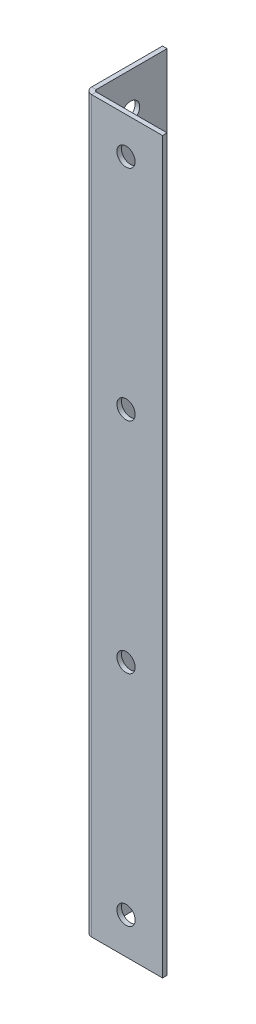
ISO-10303-21;
HEADER;
FILE_DESCRIPTION(('STEP AP214'),'2;1');
FILE_NAME('part.step','',(''),(''),'','','');
FILE_SCHEMA(('AUTOMOTIVE_DESIGN { 1 0 10303 214 1 1 1 1 }'));
ENDSEC;
DATA;
#1=APPLICATION_CONTEXT('core data for automotive mechanical design processes');
#2=APPLICATION_PROTOCOL_DEFINITION('international standard','automotive_design',2000,#1);
#3=PRODUCT_CONTEXT('',#1,'mechanical');
#4=PRODUCT('Part','Part','',(#3));
#5=PRODUCT_RELATED_PRODUCT_CATEGORY('part','',(#4));
#6=PRODUCT_DEFINITION_FORMATION('','',#4);
#7=PRODUCT_DEFINITION_CONTEXT('part definition',#1,'design');
#8=PRODUCT_DEFINITION('design','',#6,#7);
#9=PRODUCT_DEFINITION_SHAPE('','',#8);
#10=(LENGTH_UNIT() NAMED_UNIT(*) SI_UNIT(.MILLI.,.METRE.));
#11=(NAMED_UNIT(*) PLANE_ANGLE_UNIT() SI_UNIT($,.RADIAN.));
#12=(NAMED_UNIT(*) SI_UNIT($,.STERADIAN.) SOLID_ANGLE_UNIT());
#13=UNCERTAINTY_MEASURE_WITH_UNIT(LENGTH_MEASURE(1.E-05),#10,'distance_accuracy_value','');
#14=(GEOMETRIC_REPRESENTATION_CONTEXT(3) GLOBAL_UNCERTAINTY_ASSIGNED_CONTEXT((#13)) GLOBAL_UNIT_ASSIGNED_CONTEXT((#10,
#11,#12)) REPRESENTATION_CONTEXT('',''));
#15=CARTESIAN_POINT('',(0.,0.,0.));
#16=DIRECTION('',(0.,0.,1.));
#17=DIRECTION('',(1.,0.,0.));
#18=AXIS2_PLACEMENT_3D('',#15,#16,#17);
#19=CARTESIAN_POINT('',(0.7366,254.,0.));
#20=DIRECTION('',(0.,1.,0.));
#21=DIRECTION('',(0.,0.,1.));
#22=AXIS2_PLACEMENT_3D('',#19,#20,#21);
#23=PLANE('',#22);
#24=DIRECTION('',(0.,0.,1.));
#25=VECTOR('',#24,1.);
#26=CARTESIAN_POINT('',(0.7366,254.,0.));
#27=LINE('',#26,#25);
#28=CARTESIAN_POINT('',(0.7366,254.,0.));
#29=VERTEX_POINT('',#28);
#30=CARTESIAN_POINT('',(0.7366,254.,1.5875));
#31=VERTEX_POINT('',#30);
#32=EDGE_CURVE('E11',#29,#31,#27,.T.);
#33=ORIENTED_EDGE('',*,*,#32,.F.);
#34=CARTESIAN_POINT('',(0.7366,254.,-0.7366));
#35=DIRECTION('',(0.,-1.,0.));
#36=DIRECTION('',(0.,0.,-1.));
#37=AXIS2_PLACEMENT_3D('',#34,#35,#36);
#38=CIRCLE('',#37,0.7366);
#39=CARTESIAN_POINT('',(0.,254.,-0.7366));
#40=VERTEX_POINT('',#39);
#41=EDGE_CURVE('E136',#40,#29,#38,.F.);
#42=ORIENTED_EDGE('',*,*,#41,.F.);
#43=DIRECTION('',(1.,0.,0.));
#44=VECTOR('',#43,1.);
#45=CARTESIAN_POINT('',(-1.5875,254.,-0.736600000000001));
#46=LINE('',#45,#44);
#47=CARTESIAN_POINT('',(-1.5875,254.,-0.736600000000001));
#48=VERTEX_POINT('',#47);
#49=EDGE_CURVE('E46',#48,#40,#46,.T.);
#50=ORIENTED_EDGE('',*,*,#49,.F.);
#51=CARTESIAN_POINT('',(0.7366,254.,-0.7366));
#52=DIRECTION('',(0.,1.,0.));
#53=DIRECTION('',(1.,0.,0.));
#54=AXIS2_PLACEMENT_3D('',#51,#52,#53);
#55=CIRCLE('',#54,2.3241);
#56=EDGE_CURVE('E129',#48,#31,#55,.T.);
#57=ORIENTED_EDGE('',*,*,#56,.T.);
#58=EDGE_LOOP('',(#33,#42,#50,#57));
#59=FACE_BOUND('',#58,.T.);
#60=ADVANCED_FACE('F37',(#59),#23,.T.);
#61=CARTESIAN_POINT('',(-1.5875,254.,-0.736600000000001));
#62=DIRECTION('',(0.,1.,0.));
#63=DIRECTION('',(0.,0.,1.));
#64=AXIS2_PLACEMENT_3D('',#61,#62,#63);
#65=PLANE('',#64);
#66=DIRECTION('',(1.,0.,0.));
#67=VECTOR('',#66,1.);
#68=CARTESIAN_POINT('',(0.,254.,0.));
#69=LINE('',#68,#67);
#70=CARTESIAN_POINT('',(25.4,254.,0.));
#71=VERTEX_POINT('',#70);
#72=EDGE_CURVE('E203',#29,#71,#69,.T.);
#73=ORIENTED_EDGE('',*,*,#72,.F.);
#74=ORIENTED_EDGE('',*,*,#32,.T.);
#75=DIRECTION('',(1.,0.,0.));
#76=VECTOR('',#75,1.);
#77=CARTESIAN_POINT('',(0.,254.,1.5875));
#78=LINE('',#77,#76);
#79=CARTESIAN_POINT('',(25.4,254.,1.5875));
#80=VERTEX_POINT('',#79);
#81=EDGE_CURVE('E95',#31,#80,#78,.T.);
#82=ORIENTED_EDGE('',*,*,#81,.T.);
#83=DIRECTION('',(0.,0.,1.));
#84=VECTOR('',#83,1.);
#85=CARTESIAN_POINT('',(25.4,254.,0.));
#86=LINE('',#85,#84);
#87=EDGE_CURVE('E200',#71,#80,#86,.T.);
#88=ORIENTED_EDGE('',*,*,#87,.F.);
#89=EDGE_LOOP('',(#73,#74,#82,#88));
#90=FACE_BOUND('',#89,.T.);
#91=ADVANCED_FACE('F223',(#90),#65,.T.);
#92=CARTESIAN_POINT('',(0.,0.,-0.7366));
#93=DIRECTION('',(0.,-1.,0.));
#94=DIRECTION('',(0.,0.,-1.));
#95=AXIS2_PLACEMENT_3D('',#92,#93,#94);
#96=PLANE('',#95);
#97=DIRECTION('',(-1.,0.,0.));
#98=VECTOR('',#97,1.);
#99=CARTESIAN_POINT('',(0.,0.,-0.7366));
#100=LINE('',#99,#98);
#101=CARTESIAN_POINT('',(0.,0.,-0.7366));
#102=VERTEX_POINT('',#101);
#103=CARTESIAN_POINT('',(-1.5875,0.,-0.736600000000001));
#104=VERTEX_POINT('',#103);
#105=EDGE_CURVE('E82',#102,#104,#100,.T.);
#106=ORIENTED_EDGE('',*,*,#105,.F.);
#107=CARTESIAN_POINT('',(0.7366,0.,-0.7366));
#108=DIRECTION('',(0.,-1.,0.));
#109=DIRECTION('',(0.,0.,-1.));
#110=AXIS2_PLACEMENT_3D('',#107,#108,#109);
#111=CIRCLE('',#110,0.7366);
#112=CARTESIAN_POINT('',(0.7366,0.,0.));
#113=VERTEX_POINT('',#112);
#114=EDGE_CURVE('E152',#102,#113,#111,.F.);
#115=ORIENTED_EDGE('',*,*,#114,.T.);
#116=DIRECTION('',(0.,0.,-1.));
#117=VECTOR('',#116,1.);
#118=CARTESIAN_POINT('',(0.7366,0.,1.5875));
#119=LINE('',#118,#117);
#120=CARTESIAN_POINT('',(0.7366,0.,1.5875));
#121=VERTEX_POINT('',#120);
#122=EDGE_CURVE('E89',#121,#113,#119,.T.);
#123=ORIENTED_EDGE('',*,*,#122,.F.);
#124=CARTESIAN_POINT('',(0.7366,0.,-0.7366));
#125=DIRECTION('',(0.,1.,0.));
#126=DIRECTION('',(1.,0.,0.));
#127=AXIS2_PLACEMENT_3D('',#124,#125,#126);
#128=CIRCLE('',#127,2.3241);
#129=EDGE_CURVE('E159',#104,#121,#128,.T.);
#130=ORIENTED_EDGE('',*,*,#129,.F.);
#131=EDGE_LOOP('',(#106,#115,#123,#130));
#132=FACE_BOUND('',#131,.T.);
#133=ADVANCED_FACE('F221',(#132),#96,.T.);
#134=CARTESIAN_POINT('',(0.7366,0.,1.5875));
#135=DIRECTION('',(0.,-1.,0.));
#136=DIRECTION('',(0.,0.,-1.));
#137=AXIS2_PLACEMENT_3D('',#134,#135,#136);
#138=PLANE('',#137);
#139=DIRECTION('',(0.,0.,1.));
#140=VECTOR('',#139,1.);
#141=CARTESIAN_POINT('',(0.,0.,-25.4));
#142=LINE('',#141,#140);
#143=CARTESIAN_POINT('',(0.,0.,-25.4));
#144=VERTEX_POINT('',#143);
#145=EDGE_CURVE('E154',#144,#102,#142,.T.);
#146=ORIENTED_EDGE('',*,*,#145,.T.);
#147=ORIENTED_EDGE('',*,*,#105,.T.);
#148=DIRECTION('',(0.,0.,-1.));
#149=VECTOR('',#148,1.);
#150=CARTESIAN_POINT('',(-1.5875,0.,-25.4));
#151=LINE('',#150,#149);
#152=CARTESIAN_POINT('',(-1.5875,0.,-25.4));
#153=VERTEX_POINT('',#152);
#154=EDGE_CURVE('E157',#153,#104,#151,.F.);
#155=ORIENTED_EDGE('',*,*,#154,.F.);
#156=DIRECTION('',(1.,0.,0.));
#157=VECTOR('',#156,1.);
#158=CARTESIAN_POINT('',(-1.5875,0.,-25.4));
#159=LINE('',#158,#157);
#160=EDGE_CURVE('E117',#153,#144,#159,.T.);
#161=ORIENTED_EDGE('',*,*,#160,.T.);
#162=EDGE_LOOP('',(#146,#147,#155,#161));
#163=FACE_BOUND('',#162,.T.);
#164=ADVANCED_FACE('F217',(#163),#138,.T.);
#165=CARTESIAN_POINT('',(0.,254.,1.5875));
#166=DIRECTION('',(0.,0.,-1.));
#167=DIRECTION('',(-1.,0.,0.));
#168=AXIS2_PLACEMENT_3D('',#165,#166,#167);
#169=PLANE('',#168);
#170=CARTESIAN_POINT('',(12.7000000000008,165.1,1.5875));
#171=DIRECTION('',(0.,0.,1.));
#172=DIRECTION('',(1.,0.,0.));
#173=AXIS2_PLACEMENT_3D('',#170,#171,#172);
#174=CIRCLE('',#173,3.175);
#175=CARTESIAN_POINT('',(15.8750000000008,165.1,1.5875));
#176=VERTEX_POINT('',#175);
#177=EDGE_CURVE('E184',#176,#176,#174,.T.);
#178=ORIENTED_EDGE('',*,*,#177,.F.);
#179=EDGE_LOOP('',(#178));
#180=FACE_BOUND('',#179,.T.);
#181=CARTESIAN_POINT('',(12.7000000000016,88.9,1.5875));
#182=DIRECTION('',(0.,0.,1.));
#183=DIRECTION('',(1.,0.,0.));
#184=AXIS2_PLACEMENT_3D('',#181,#182,#183);
#185=CIRCLE('',#184,3.175);
#186=CARTESIAN_POINT('',(15.8750000000016,88.9,1.5875));
#187=VERTEX_POINT('',#186);
#188=EDGE_CURVE('E494',#187,#187,#185,.T.);
#189=ORIENTED_EDGE('',*,*,#188,.F.);
#190=EDGE_LOOP('',(#189));
#191=FACE_BOUND('',#190,.T.);
#192=CARTESIAN_POINT('',(12.7000000000024,12.7,1.5875));
#193=DIRECTION('',(0.,0.,1.));
#194=DIRECTION('',(1.,0.,0.));
#195=AXIS2_PLACEMENT_3D('',#192,#193,#194);
#196=CIRCLE('',#195,3.175);
#197=CARTESIAN_POINT('',(15.8750000000024,12.7,1.5875));
#198=VERTEX_POINT('',#197);
#199=EDGE_CURVE('E197',#198,#198,#196,.T.);
#200=ORIENTED_EDGE('',*,*,#199,.F.);
#201=EDGE_LOOP('',(#200));
#202=FACE_BOUND('',#201,.T.);
#203=CARTESIAN_POINT('',(12.7,241.3,1.5875));
#204=DIRECTION('',(0.,0.,1.));
#205=DIRECTION('',(1.,0.,0.));
#206=AXIS2_PLACEMENT_3D('',#203,#204,#205);
#207=CIRCLE('',#206,3.175);
#208=CARTESIAN_POINT('',(15.875,241.3,1.5875));
#209=VERTEX_POINT('',#208);
#210=EDGE_CURVE('E180',#209,#209,#207,.T.);
#211=ORIENTED_EDGE('',*,*,#210,.F.);
#212=EDGE_LOOP('',(#211));
#213=FACE_BOUND('',#212,.T.);
#214=DIRECTION('',(1.,0.,0.));
#215=VECTOR('',#214,1.);
#216=CARTESIAN_POINT('',(0.,0.,1.5875));
#217=LINE('',#216,#215);
#218=CARTESIAN_POINT('',(25.4,0.,1.5875));
#219=VERTEX_POINT('',#218);
#220=EDGE_CURVE('E142',#121,#219,#217,.T.);
#221=ORIENTED_EDGE('',*,*,#220,.T.);
#222=DIRECTION('',(0.,-1.,0.));
#223=VECTOR('',#222,1.);
#224=CARTESIAN_POINT('',(25.4,254.,1.5875));
#225=LINE('',#224,#223);
#226=EDGE_CURVE('E173',#80,#219,#225,.T.);
#227=ORIENTED_EDGE('',*,*,#226,.F.);
#228=ORIENTED_EDGE('',*,*,#81,.F.);
#229=DIRECTION('',(0.,-1.,0.));
#230=VECTOR('',#229,1.);
#231=CARTESIAN_POINT('',(0.7366,254.,1.5875));
#232=LINE('',#231,#230);
#233=EDGE_CURVE('E141',#31,#121,#232,.T.);
#234=ORIENTED_EDGE('',*,*,#233,.T.);
#235=EDGE_LOOP('',(#221,#227,#228,#234));
#236=FACE_BOUND('',#235,.T.);
#237=ADVANCED_FACE('F229',(#180,#191,#202,#213,#236),#169,.F.);
#238=CARTESIAN_POINT('',(25.4,254.,0.));
#239=DIRECTION('',(1.,0.,0.));
#240=DIRECTION('',(0.,0.,-1.));
#241=AXIS2_PLACEMENT_3D('',#238,#239,#240);
#242=PLANE('',#241);
#243=DIRECTION('',(0.,0.,1.));
#244=VECTOR('',#243,1.);
#245=CARTESIAN_POINT('',(25.4,0.,0.));
#246=LINE('',#245,#244);
#247=CARTESIAN_POINT('',(25.4,0.,0.));
#248=VERTEX_POINT('',#247);
#249=EDGE_CURVE('E145',#248,#219,#246,.T.);
#250=ORIENTED_EDGE('',*,*,#249,.F.);
#251=DIRECTION('',(0.,-1.,0.));
#252=VECTOR('',#251,1.);
#253=CARTESIAN_POINT('',(25.4,254.,0.));
#254=LINE('',#253,#252);
#255=EDGE_CURVE('E171',#71,#248,#254,.T.);
#256=ORIENTED_EDGE('',*,*,#255,.F.);
#257=ORIENTED_EDGE('',*,*,#87,.T.);
#258=ORIENTED_EDGE('',*,*,#226,.T.);
#259=EDGE_LOOP('',(#250,#256,#257,#258));
#260=FACE_BOUND('',#259,.T.);
#261=ADVANCED_FACE('F258',(#260),#242,.T.);
#262=CARTESIAN_POINT('',(0.,254.,0.));
#263=DIRECTION('',(0.,0.,-1.));
#264=DIRECTION('',(-1.,0.,0.));
#265=AXIS2_PLACEMENT_3D('',#262,#263,#264);
#266=PLANE('',#265);
#267=CARTESIAN_POINT('',(12.7000000000008,165.1,0.));
#268=DIRECTION('',(0.,0.,-1.));
#269=DIRECTION('',(-1.,0.,0.));
#270=AXIS2_PLACEMENT_3D('',#267,#268,#269);
#271=CIRCLE('',#270,3.175);
#272=CARTESIAN_POINT('',(9.5250000000008,165.1,0.));
#273=VERTEX_POINT('',#272);
#274=EDGE_CURVE('E40',#273,#273,#271,.T.);
#275=ORIENTED_EDGE('',*,*,#274,.F.);
#276=EDGE_LOOP('',(#275));
#277=FACE_BOUND('',#276,.T.);
#278=CARTESIAN_POINT('',(12.7000000000016,88.9,0.));
#279=DIRECTION('',(0.,0.,-1.));
#280=DIRECTION('',(-1.,0.,0.));
#281=AXIS2_PLACEMENT_3D('',#278,#279,#280);
#282=CIRCLE('',#281,3.175);
#283=CARTESIAN_POINT('',(9.5250000000016,88.9,0.));
#284=VERTEX_POINT('',#283);
#285=EDGE_CURVE('E183',#284,#284,#282,.T.);
#286=ORIENTED_EDGE('',*,*,#285,.F.);
#287=EDGE_LOOP('',(#286));
#288=FACE_BOUND('',#287,.T.);
#289=CARTESIAN_POINT('',(12.7000000000024,12.7,0.));
#290=DIRECTION('',(0.,0.,-1.));
#291=DIRECTION('',(-1.,0.,0.));
#292=AXIS2_PLACEMENT_3D('',#289,#290,#291);
#293=CIRCLE('',#292,3.175);
#294=CARTESIAN_POINT('',(9.52500000000239,12.7,0.));
#295=VERTEX_POINT('',#294);
#296=EDGE_CURVE('E181',#295,#295,#293,.T.);
#297=ORIENTED_EDGE('',*,*,#296,.F.);
#298=EDGE_LOOP('',(#297));
#299=FACE_BOUND('',#298,.T.);
#300=CARTESIAN_POINT('',(12.7,241.3,0.));
#301=DIRECTION('',(0.,0.,-1.));
#302=DIRECTION('',(-1.,0.,0.));
#303=AXIS2_PLACEMENT_3D('',#300,#301,#302);
#304=CIRCLE('',#303,3.175);
#305=CARTESIAN_POINT('',(9.525,241.3,0.));
#306=VERTEX_POINT('',#305);
#307=EDGE_CURVE('E146',#306,#306,#304,.T.);
#308=ORIENTED_EDGE('',*,*,#307,.F.);
#309=EDGE_LOOP('',(#308));
#310=FACE_BOUND('',#309,.T.);
#311=DIRECTION('',(1.,0.,0.));
#312=VECTOR('',#311,1.);
#313=CARTESIAN_POINT('',(0.,0.,0.));
#314=LINE('',#313,#312);
#315=EDGE_CURVE('E149',#113,#248,#314,.T.);
#316=ORIENTED_EDGE('',*,*,#315,.F.);
#317=DIRECTION('',(0.,-1.,0.));
#318=VECTOR('',#317,1.);
#319=CARTESIAN_POINT('',(0.7366,254.,0.));
#320=LINE('',#319,#318);
#321=EDGE_CURVE('E168',#29,#113,#320,.T.);
#322=ORIENTED_EDGE('',*,*,#321,.F.);
#323=ORIENTED_EDGE('',*,*,#72,.T.);
#324=ORIENTED_EDGE('',*,*,#255,.T.);
#325=EDGE_LOOP('',(#316,#322,#323,#324));
#326=FACE_BOUND('',#325,.T.);
#327=ADVANCED_FACE('F263',(#277,#288,#299,#310,#326),#266,.T.);
#328=CARTESIAN_POINT('',(0.7366,254.,-0.7366));
#329=DIRECTION('',(0.,-1.,0.));
#330=DIRECTION('',(0.,0.,-1.));
#331=AXIS2_PLACEMENT_3D('',#328,#329,#330);
#332=CYLINDRICAL_SURFACE('',#331,0.7366);
#333=ORIENTED_EDGE('',*,*,#114,.F.);
#334=DIRECTION('',(0.,-1.,0.));
#335=VECTOR('',#334,1.);
#336=CARTESIAN_POINT('',(0.,254.,-0.7366));
#337=LINE('',#336,#335);
#338=EDGE_CURVE('E165',#40,#102,#337,.T.);
#339=ORIENTED_EDGE('',*,*,#338,.F.);
#340=ORIENTED_EDGE('',*,*,#41,.T.);
#341=ORIENTED_EDGE('',*,*,#321,.T.);
#342=EDGE_LOOP('',(#333,#339,#340,#341));
#343=FACE_BOUND('',#342,.T.);
#344=ADVANCED_FACE('F210',(#343),#332,.F.);
#345=CARTESIAN_POINT('',(0.,254.,-25.4));
#346=DIRECTION('',(1.,0.,0.));
#347=DIRECTION('',(0.,0.,-1.));
#348=AXIS2_PLACEMENT_3D('',#345,#346,#347);
#349=PLANE('',#348);
#350=CARTESIAN_POINT('',(0.,165.1,-12.6999999999992));
#351=DIRECTION('',(1.,0.,0.));
#352=DIRECTION('',(0.,0.,-1.));
#353=AXIS2_PLACEMENT_3D('',#350,#351,#352);
#354=CIRCLE('',#353,3.175);
#355=CARTESIAN_POINT('',(0.,165.1,-15.8749999999992));
#356=VERTEX_POINT('',#355);
#357=EDGE_CURVE('E468',#356,#356,#354,.T.);
#358=ORIENTED_EDGE('',*,*,#357,.F.);
#359=EDGE_LOOP('',(#358));
#360=FACE_BOUND('',#359,.T.);
#361=CARTESIAN_POINT('',(0.,88.9,-12.6999999999984));
#362=DIRECTION('',(1.,0.,0.));
#363=DIRECTION('',(0.,0.,-1.));
#364=AXIS2_PLACEMENT_3D('',#361,#362,#363);
#365=CIRCLE('',#364,3.175);
#366=CARTESIAN_POINT('',(0.,88.9,-15.8749999999984));
#367=VERTEX_POINT('',#366);
#368=EDGE_CURVE('E476',#367,#367,#365,.T.);
#369=ORIENTED_EDGE('',*,*,#368,.F.);
#370=EDGE_LOOP('',(#369));
#371=FACE_BOUND('',#370,.T.);
#372=CARTESIAN_POINT('',(0.,12.7,-12.6999999999976));
#373=DIRECTION('',(1.,0.,0.));
#374=DIRECTION('',(0.,0.,-1.));
#375=AXIS2_PLACEMENT_3D('',#372,#373,#374);
#376=CIRCLE('',#375,3.175);
#377=CARTESIAN_POINT('',(0.,12.7,-15.8749999999976));
#378=VERTEX_POINT('',#377);
#379=EDGE_CURVE('E472',#378,#378,#376,.T.);
#380=ORIENTED_EDGE('',*,*,#379,.F.);
#381=EDGE_LOOP('',(#380));
#382=FACE_BOUND('',#381,.T.);
#383=CARTESIAN_POINT('',(0.,241.3,-12.7));
#384=DIRECTION('',(1.,0.,0.));
#385=DIRECTION('',(0.,0.,-1.));
#386=AXIS2_PLACEMENT_3D('',#383,#384,#385);
#387=CIRCLE('',#386,3.175);
#388=CARTESIAN_POINT('',(0.,241.3,-15.875));
#389=VERTEX_POINT('',#388);
#390=EDGE_CURVE('E490',#389,#389,#387,.T.);
#391=ORIENTED_EDGE('',*,*,#390,.F.);
#392=EDGE_LOOP('',(#391));
#393=FACE_BOUND('',#392,.T.);
#394=ORIENTED_EDGE('',*,*,#145,.F.);
#395=DIRECTION('',(0.,-1.,0.));
#396=VECTOR('',#395,1.);
#397=CARTESIAN_POINT('',(0.,254.,-25.4));
#398=LINE('',#397,#396);
#399=CARTESIAN_POINT('',(0.,254.,-25.4));
#400=VERTEX_POINT('',#399);
#401=EDGE_CURVE('E119',#400,#144,#398,.T.);
#402=ORIENTED_EDGE('',*,*,#401,.F.);
#403=DIRECTION('',(0.,0.,1.));
#404=VECTOR('',#403,1.);
#405=CARTESIAN_POINT('',(0.,254.,-25.4));
#406=LINE('',#405,#404);
#407=EDGE_CURVE('E134',#400,#40,#406,.T.);
#408=ORIENTED_EDGE('',*,*,#407,.T.);
#409=ORIENTED_EDGE('',*,*,#338,.T.);
#410=EDGE_LOOP('',(#394,#402,#408,#409));
#411=FACE_BOUND('',#410,.T.);
#412=ADVANCED_FACE('F216',(#360,#371,#382,#393,#411),#349,.T.);
#413=CARTESIAN_POINT('',(-1.5875,254.,-25.4));
#414=DIRECTION('',(0.,0.,-1.));
#415=DIRECTION('',(-1.,0.,0.));
#416=AXIS2_PLACEMENT_3D('',#413,#414,#415);
#417=PLANE('',#416);
#418=ORIENTED_EDGE('',*,*,#160,.F.);
#419=DIRECTION('',(0.,-1.,0.));
#420=VECTOR('',#419,1.);
#421=CARTESIAN_POINT('',(-1.5875,254.,-25.4));
#422=LINE('',#421,#420);
#423=CARTESIAN_POINT('',(-1.5875,254.,-25.4));
#424=VERTEX_POINT('',#423);
#425=EDGE_CURVE('E111',#424,#153,#422,.T.);
#426=ORIENTED_EDGE('',*,*,#425,.F.);
#427=DIRECTION('',(1.,0.,0.));
#428=VECTOR('',#427,1.);
#429=CARTESIAN_POINT('',(-1.5875,254.,-25.4));
#430=LINE('',#429,#428);
#431=EDGE_CURVE('E115',#424,#400,#430,.T.);
#432=ORIENTED_EDGE('',*,*,#431,.T.);
#433=ORIENTED_EDGE('',*,*,#401,.T.);
#434=EDGE_LOOP('',(#418,#426,#432,#433));
#435=FACE_BOUND('',#434,.T.);
#436=ADVANCED_FACE('F113',(#435),#417,.T.);
#437=CARTESIAN_POINT('',(-1.5875,254.,-25.4));
#438=DIRECTION('',(1.,0.,0.));
#439=DIRECTION('',(0.,0.,-1.));
#440=AXIS2_PLACEMENT_3D('',#437,#438,#439);
#441=PLANE('',#440);
#442=CARTESIAN_POINT('',(-1.5875,165.1,-12.6999999999992));
#443=DIRECTION('',(-1.,0.,0.));
#444=DIRECTION('',(0.,0.,1.));
#445=AXIS2_PLACEMENT_3D('',#442,#443,#444);
#446=CIRCLE('',#445,3.175);
#447=CARTESIAN_POINT('',(-1.5875,165.1,-9.5249999999992));
#448=VERTEX_POINT('',#447);
#449=EDGE_CURVE('E471',#448,#448,#446,.T.);
#450=ORIENTED_EDGE('',*,*,#449,.F.);
#451=EDGE_LOOP('',(#450));
#452=FACE_BOUND('',#451,.T.);
#453=CARTESIAN_POINT('',(-1.5875,88.9,-12.6999999999984));
#454=DIRECTION('',(-1.,0.,0.));
#455=DIRECTION('',(0.,0.,1.));
#456=AXIS2_PLACEMENT_3D('',#453,#454,#455);
#457=CIRCLE('',#456,3.175);
#458=CARTESIAN_POINT('',(-1.5875,88.9,-9.5249999999984));
#459=VERTEX_POINT('',#458);
#460=EDGE_CURVE('E473',#459,#459,#457,.T.);
#461=ORIENTED_EDGE('',*,*,#460,.F.);
#462=EDGE_LOOP('',(#461));
#463=FACE_BOUND('',#462,.T.);
#464=CARTESIAN_POINT('',(-1.5875,12.7,-12.6999999999976));
#465=DIRECTION('',(-1.,0.,0.));
#466=DIRECTION('',(0.,0.,1.));
#467=AXIS2_PLACEMENT_3D('',#464,#465,#466);
#468=CIRCLE('',#467,3.175);
#469=CARTESIAN_POINT('',(-1.5875,12.7,-9.5249999999976));
#470=VERTEX_POINT('',#469);
#471=EDGE_CURVE('E479',#470,#470,#468,.T.);
#472=ORIENTED_EDGE('',*,*,#471,.F.);
#473=EDGE_LOOP('',(#472));
#474=FACE_BOUND('',#473,.T.);
#475=CARTESIAN_POINT('',(-1.5875,241.3,-12.7));
#476=DIRECTION('',(-1.,0.,0.));
#477=DIRECTION('',(0.,0.,1.));
#478=AXIS2_PLACEMENT_3D('',#475,#476,#477);
#479=CIRCLE('',#478,3.175);
#480=CARTESIAN_POINT('',(-1.5875,241.3,-9.525));
#481=VERTEX_POINT('',#480);
#482=EDGE_CURVE('E487',#481,#481,#479,.T.);
#483=ORIENTED_EDGE('',*,*,#482,.F.);
#484=EDGE_LOOP('',(#483));
#485=FACE_BOUND('',#484,.T.);
#486=ORIENTED_EDGE('',*,*,#154,.T.);
#487=DIRECTION('',(0.,-1.,0.));
#488=VECTOR('',#487,1.);
#489=CARTESIAN_POINT('',(-1.5875,254.,-0.736600000000001));
#490=LINE('',#489,#488);
#491=EDGE_CURVE('E120',#48,#104,#490,.T.);
#492=ORIENTED_EDGE('',*,*,#491,.F.);
#493=DIRECTION('',(0.,0.,-1.));
#494=VECTOR('',#493,1.);
#495=CARTESIAN_POINT('',(-1.5875,254.,-25.4));
#496=LINE('',#495,#494);
#497=EDGE_CURVE('E124',#424,#48,#496,.F.);
#498=ORIENTED_EDGE('',*,*,#497,.F.);
#499=ORIENTED_EDGE('',*,*,#425,.T.);
#500=EDGE_LOOP('',(#486,#492,#498,#499));
#501=FACE_BOUND('',#500,.T.);
#502=ADVANCED_FACE('F125',(#452,#463,#474,#485,#501),#441,.F.);
#503=CARTESIAN_POINT('',(0.7366,254.,-0.7366));
#504=DIRECTION('',(0.,-1.,0.));
#505=DIRECTION('',(0.,0.,-1.));
#506=AXIS2_PLACEMENT_3D('',#503,#504,#505);
#507=CYLINDRICAL_SURFACE('',#506,2.3241);
#508=ORIENTED_EDGE('',*,*,#129,.T.);
#509=ORIENTED_EDGE('',*,*,#233,.F.);
#510=ORIENTED_EDGE('',*,*,#56,.F.);
#511=ORIENTED_EDGE('',*,*,#491,.T.);
#512=EDGE_LOOP('',(#508,#509,#510,#511));
#513=FACE_BOUND('',#512,.T.);
#514=ADVANCED_FACE('F219',(#513),#507,.T.);
#515=CARTESIAN_POINT('',(0.7366,254.,-0.7366));
#516=DIRECTION('',(0.,-1.,0.));
#517=DIRECTION('',(-1.,0.,0.));
#518=AXIS2_PLACEMENT_3D('',#515,#516,#517);
#519=PLANE('',#518);
#520=ORIENTED_EDGE('',*,*,#497,.T.);
#521=ORIENTED_EDGE('',*,*,#49,.T.);
#522=ORIENTED_EDGE('',*,*,#407,.F.);
#523=ORIENTED_EDGE('',*,*,#431,.F.);
#524=EDGE_LOOP('',(#520,#521,#522,#523));
#525=FACE_BOUND('',#524,.T.);
#526=ADVANCED_FACE('F132',(#525),#519,.F.);
#527=CARTESIAN_POINT('',(0.7366,0.,-0.7366));
#528=DIRECTION('',(0.,-1.,0.));
#529=DIRECTION('',(-1.,0.,0.));
#530=AXIS2_PLACEMENT_3D('',#527,#528,#529);
#531=PLANE('',#530);
#532=ORIENTED_EDGE('',*,*,#220,.F.);
#533=ORIENTED_EDGE('',*,*,#122,.T.);
#534=ORIENTED_EDGE('',*,*,#315,.T.);
#535=ORIENTED_EDGE('',*,*,#249,.T.);
#536=EDGE_LOOP('',(#532,#533,#534,#535));
#537=FACE_BOUND('',#536,.T.);
#538=ADVANCED_FACE('F307',(#537),#531,.T.);
#539=CARTESIAN_POINT('',(12.7,241.3,-25.4));
#540=DIRECTION('',(0.,0.,1.));
#541=DIRECTION('',(1.,0.,0.));
#542=AXIS2_PLACEMENT_3D('',#539,#540,#541);
#543=CYLINDRICAL_SURFACE('',#542,3.175);
#544=ORIENTED_EDGE('',*,*,#307,.T.);
#545=EDGE_LOOP('',(#544));
#546=FACE_BOUND('',#545,.T.);
#547=ORIENTED_EDGE('',*,*,#210,.T.);
#548=EDGE_LOOP('',(#547));
#549=FACE_BOUND('',#548,.T.);
#550=ADVANCED_FACE('F317',(#546,#549),#543,.F.);
#551=CARTESIAN_POINT('',(12.7000000000024,12.7,-25.4));
#552=DIRECTION('',(0.,0.,1.));
#553=DIRECTION('',(1.,0.,0.));
#554=AXIS2_PLACEMENT_3D('',#551,#552,#553);
#555=CYLINDRICAL_SURFACE('',#554,3.175);
#556=ORIENTED_EDGE('',*,*,#296,.T.);
#557=EDGE_LOOP('',(#556));
#558=FACE_BOUND('',#557,.T.);
#559=ORIENTED_EDGE('',*,*,#199,.T.);
#560=EDGE_LOOP('',(#559));
#561=FACE_BOUND('',#560,.T.);
#562=ADVANCED_FACE('F344',(#558,#561),#555,.F.);
#563=CARTESIAN_POINT('',(12.7000000000016,88.9,-25.4));
#564=DIRECTION('',(0.,0.,1.));
#565=DIRECTION('',(1.,0.,0.));
#566=AXIS2_PLACEMENT_3D('',#563,#564,#565);
#567=CYLINDRICAL_SURFACE('',#566,3.175);
#568=ORIENTED_EDGE('',*,*,#285,.T.);
#569=EDGE_LOOP('',(#568));
#570=FACE_BOUND('',#569,.T.);
#571=ORIENTED_EDGE('',*,*,#188,.T.);
#572=EDGE_LOOP('',(#571));
#573=FACE_BOUND('',#572,.T.);
#574=ADVANCED_FACE('F355',(#570,#573),#567,.F.);
#575=CARTESIAN_POINT('',(12.7000000000008,165.1,-25.4));
#576=DIRECTION('',(0.,0.,1.));
#577=DIRECTION('',(1.,0.,0.));
#578=AXIS2_PLACEMENT_3D('',#575,#576,#577);
#579=CYLINDRICAL_SURFACE('',#578,3.175);
#580=ORIENTED_EDGE('',*,*,#274,.T.);
#581=EDGE_LOOP('',(#580));
#582=FACE_BOUND('',#581,.T.);
#583=ORIENTED_EDGE('',*,*,#177,.T.);
#584=EDGE_LOOP('',(#583));
#585=FACE_BOUND('',#584,.T.);
#586=ADVANCED_FACE('F366',(#582,#585),#579,.F.);
#587=CARTESIAN_POINT('',(25.4,241.3,-12.7));
#588=DIRECTION('',(-1.,0.,0.));
#589=DIRECTION('',(0.,0.,1.));
#590=AXIS2_PLACEMENT_3D('',#587,#588,#589);
#591=CYLINDRICAL_SURFACE('',#590,3.175);
#592=ORIENTED_EDGE('',*,*,#390,.T.);
#593=EDGE_LOOP('',(#592));
#594=FACE_BOUND('',#593,.T.);
#595=ORIENTED_EDGE('',*,*,#482,.T.);
#596=EDGE_LOOP('',(#595));
#597=FACE_BOUND('',#596,.T.);
#598=ADVANCED_FACE('F376',(#594,#597),#591,.F.);
#599=CARTESIAN_POINT('',(25.4,12.7,-12.6999999999976));
#600=DIRECTION('',(-1.,0.,0.));
#601=DIRECTION('',(0.,0.,1.));
#602=AXIS2_PLACEMENT_3D('',#599,#600,#601);
#603=CYLINDRICAL_SURFACE('',#602,3.175);
#604=ORIENTED_EDGE('',*,*,#379,.T.);
#605=EDGE_LOOP('',(#604));
#606=FACE_BOUND('',#605,.T.);
#607=ORIENTED_EDGE('',*,*,#471,.T.);
#608=EDGE_LOOP('',(#607));
#609=FACE_BOUND('',#608,.T.);
#610=ADVANCED_FACE('F402',(#606,#609),#603,.F.);
#611=CARTESIAN_POINT('',(25.4,88.9,-12.6999999999984));
#612=DIRECTION('',(-1.,0.,0.));
#613=DIRECTION('',(0.,0.,1.));
#614=AXIS2_PLACEMENT_3D('',#611,#612,#613);
#615=CYLINDRICAL_SURFACE('',#614,3.175);
#616=ORIENTED_EDGE('',*,*,#368,.T.);
#617=EDGE_LOOP('',(#616));
#618=FACE_BOUND('',#617,.T.);
#619=ORIENTED_EDGE('',*,*,#460,.T.);
#620=EDGE_LOOP('',(#619));
#621=FACE_BOUND('',#620,.T.);
#622=ADVANCED_FACE('F413',(#618,#621),#615,.F.);
#623=CARTESIAN_POINT('',(25.4,165.1,-12.6999999999992));
#624=DIRECTION('',(-1.,0.,0.));
#625=DIRECTION('',(0.,0.,1.));
#626=AXIS2_PLACEMENT_3D('',#623,#624,#625);
#627=CYLINDRICAL_SURFACE('',#626,3.175);
#628=ORIENTED_EDGE('',*,*,#357,.T.);
#629=EDGE_LOOP('',(#628));
#630=FACE_BOUND('',#629,.T.);
#631=ORIENTED_EDGE('',*,*,#449,.T.);
#632=EDGE_LOOP('',(#631));
#633=FACE_BOUND('',#632,.T.);
#634=ADVANCED_FACE('F424',(#630,#633),#627,.F.);
#635=CLOSED_SHELL('',(#60,#91,#133,#164,#237,#261,#327,#344,#412,#436,#502,#514,#526,#538,#550,
#562,#574,#586,#598,#610,#622,#634));
#636=MANIFOLD_SOLID_BREP('B2',#635);
#637=ADVANCED_BREP_SHAPE_REPRESENTATION('',(#18,#636),#14);
#638=SHAPE_DEFINITION_REPRESENTATION(#9,#637);
ENDSEC;
END-ISO-10303-21;
